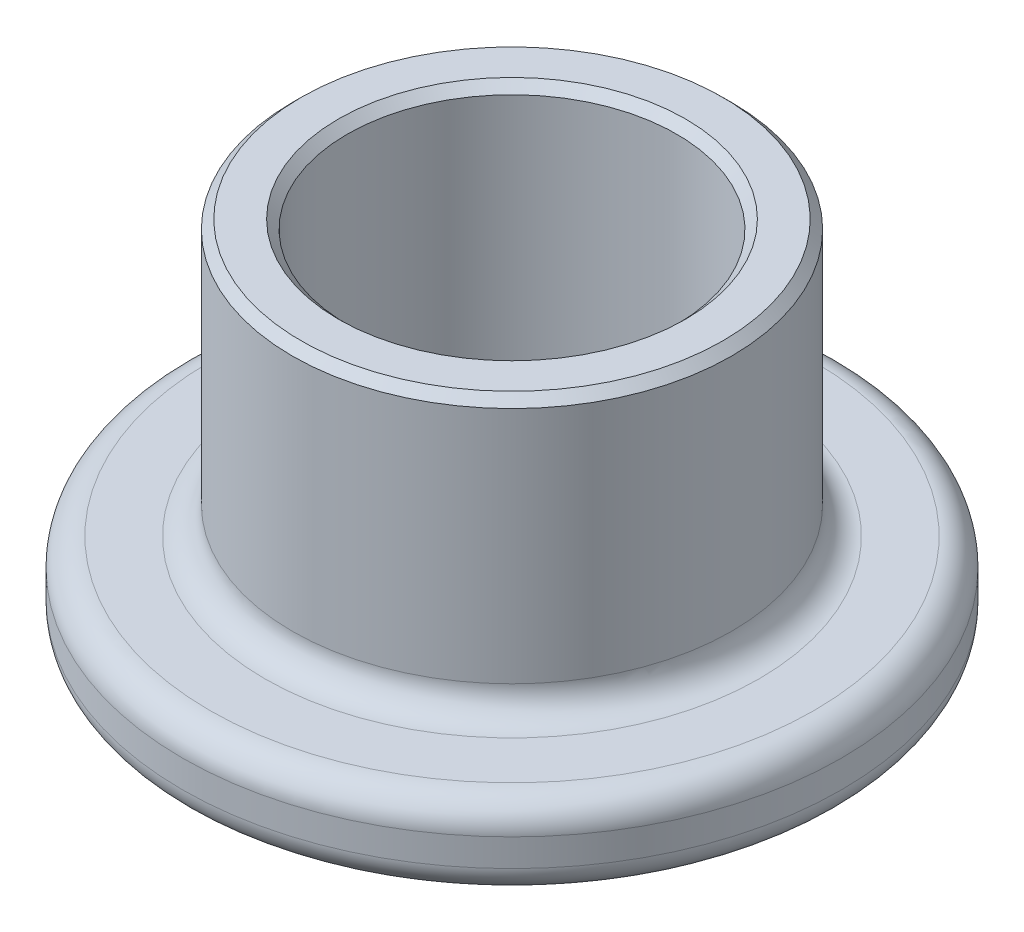
ISO-10303-21;
HEADER;
FILE_DESCRIPTION(('STEP AP214'),'2;1');
FILE_NAME('part.step','',(''),(''),'','','');
FILE_SCHEMA(('AUTOMOTIVE_DESIGN { 1 0 10303 214 1 1 1 1 }'));
ENDSEC;
DATA;
#1=APPLICATION_CONTEXT('core data for automotive mechanical design processes');
#2=APPLICATION_PROTOCOL_DEFINITION('international standard','automotive_design',2000,#1);
#3=PRODUCT_CONTEXT('',#1,'mechanical');
#4=PRODUCT('Part','Part','',(#3));
#5=PRODUCT_RELATED_PRODUCT_CATEGORY('part','',(#4));
#6=PRODUCT_DEFINITION_FORMATION('','',#4);
#7=PRODUCT_DEFINITION_CONTEXT('part definition',#1,'design');
#8=PRODUCT_DEFINITION('design','',#6,#7);
#9=PRODUCT_DEFINITION_SHAPE('','',#8);
#10=(LENGTH_UNIT() NAMED_UNIT(*) SI_UNIT(.MILLI.,.METRE.));
#11=(NAMED_UNIT(*) PLANE_ANGLE_UNIT() SI_UNIT($,.RADIAN.));
#12=(NAMED_UNIT(*) SI_UNIT($,.STERADIAN.) SOLID_ANGLE_UNIT());
#13=UNCERTAINTY_MEASURE_WITH_UNIT(LENGTH_MEASURE(1.E-05),#10,'distance_accuracy_value','');
#14=(GEOMETRIC_REPRESENTATION_CONTEXT(3) GLOBAL_UNCERTAINTY_ASSIGNED_CONTEXT((#13)) GLOBAL_UNIT_ASSIGNED_CONTEXT((#10,
#11,#12)) REPRESENTATION_CONTEXT('',''));
#15=CARTESIAN_POINT('',(0.,0.,0.));
#16=DIRECTION('',(0.,0.,1.));
#17=DIRECTION('',(1.,0.,0.));
#18=AXIS2_PLACEMENT_3D('',#15,#16,#17);
#19=CARTESIAN_POINT('',(0.,1.89666781767956,0.));
#20=DIRECTION('',(0.,1.,0.));
#21=DIRECTION('',(-1.,0.,0.));
#22=AXIS2_PLACEMENT_3D('',#19,#20,#21);
#23=CYLINDRICAL_SURFACE('',#22,2.38125);
#24=CARTESIAN_POINT('',(0.,0.127000000000002,0.));
#25=DIRECTION('',(0.,1.,0.));
#26=DIRECTION('',(-1.,0.,0.));
#27=AXIS2_PLACEMENT_3D('',#24,#25,#26);
#28=CIRCLE('',#27,2.38125);
#29=CARTESIAN_POINT('',(-2.38125,0.127000000000002,0.));
#30=VERTEX_POINT('',#29);
#31=EDGE_CURVE('E45',#30,#30,#28,.F.);
#32=ORIENTED_EDGE('',*,*,#31,.T.);
#33=EDGE_LOOP('',(#32));
#34=FACE_BOUND('',#33,.T.);
#35=CARTESIAN_POINT('',(0.,5.032375,0.));
#36=DIRECTION('',(0.,-1.,0.));
#37=DIRECTION('',(1.,0.,0.));
#38=AXIS2_PLACEMENT_3D('',#35,#36,#37);
#39=CIRCLE('',#38,2.38125);
#40=CARTESIAN_POINT('',(2.38125,5.032375,0.));
#41=VERTEX_POINT('',#40);
#42=EDGE_CURVE('E50',#41,#41,#39,.F.);
#43=ORIENTED_EDGE('',*,*,#42,.T.);
#44=EDGE_LOOP('',(#43));
#45=FACE_BOUND('',#44,.T.);
#46=ADVANCED_FACE('F30',(#34,#45),#23,.F.);
#47=CARTESIAN_POINT('',(2.38125,0.,0.));
#48=DIRECTION('',(0.,1.,0.));
#49=DIRECTION('',(-1.,0.,0.));
#50=AXIS2_PLACEMENT_3D('',#47,#48,#49);
#51=PLANE('',#50);
#52=CARTESIAN_POINT('',(0.,0.,0.));
#53=DIRECTION('',(0.,1.,0.));
#54=DIRECTION('',(-1.,0.,0.));
#55=AXIS2_PLACEMENT_3D('',#52,#53,#54);
#56=CIRCLE('',#55,2.50825);
#57=CARTESIAN_POINT('',(-2.50825,0.,0.));
#58=VERTEX_POINT('',#57);
#59=EDGE_CURVE('E53',#58,#58,#56,.T.);
#60=ORIENTED_EDGE('',*,*,#59,.T.);
#61=EDGE_LOOP('',(#60));
#62=FACE_BOUND('',#61,.T.);
#63=CARTESIAN_POINT('',(0.,0.,0.));
#64=DIRECTION('',(0.,1.,0.));
#65=DIRECTION('',(-1.,0.,0.));
#66=AXIS2_PLACEMENT_3D('',#63,#64,#65);
#67=CIRCLE('',#66,4.365625);
#68=CARTESIAN_POINT('',(-4.365625,0.,0.));
#69=VERTEX_POINT('',#68);
#70=EDGE_CURVE('E65',#69,#69,#67,.F.);
#71=ORIENTED_EDGE('',*,*,#70,.T.);
#72=EDGE_LOOP('',(#71));
#73=FACE_BOUND('',#72,.T.);
#74=ADVANCED_FACE('F106',(#62,#73),#51,.F.);
#75=CARTESIAN_POINT('',(0.,1.89666781767956,0.));
#76=DIRECTION('',(0.,1.,0.));
#77=DIRECTION('',(-1.,0.,0.));
#78=AXIS2_PLACEMENT_3D('',#75,#76,#77);
#79=CYLINDRICAL_SURFACE('',#78,4.7625);
#80=CARTESIAN_POINT('',(0.,0.396875,0.));
#81=DIRECTION('',(0.,1.,0.));
#82=DIRECTION('',(-1.,0.,0.));
#83=AXIS2_PLACEMENT_3D('',#80,#81,#82);
#84=CIRCLE('',#83,4.7625);
#85=CARTESIAN_POINT('',(-4.7625,0.396874999999999,0.));
#86=VERTEX_POINT('',#85);
#87=EDGE_CURVE('E68',#86,#86,#84,.T.);
#88=ORIENTED_EDGE('',*,*,#87,.T.);
#89=EDGE_LOOP('',(#88));
#90=FACE_BOUND('',#89,.T.);
#91=CARTESIAN_POINT('',(0.,0.793749999999999,0.));
#92=DIRECTION('',(0.,-1.,0.));
#93=DIRECTION('',(1.,0.,0.));
#94=AXIS2_PLACEMENT_3D('',#91,#92,#93);
#95=CIRCLE('',#94,4.7625);
#96=CARTESIAN_POINT('',(4.7625,0.79375,0.));
#97=VERTEX_POINT('',#96);
#98=EDGE_CURVE('E71',#97,#97,#95,.T.);
#99=ORIENTED_EDGE('',*,*,#98,.T.);
#100=EDGE_LOOP('',(#99));
#101=FACE_BOUND('',#100,.T.);
#102=ADVANCED_FACE('F75',(#90,#101),#79,.T.);
#103=CARTESIAN_POINT('',(4.7625,1.190625,0.));
#104=DIRECTION('',(0.,-1.,0.));
#105=DIRECTION('',(1.,0.,0.));
#106=AXIS2_PLACEMENT_3D('',#103,#104,#105);
#107=PLANE('',#106);
#108=CARTESIAN_POINT('',(0.,1.190625,0.));
#109=DIRECTION('',(0.,-1.,0.));
#110=DIRECTION('',(1.,0.,0.));
#111=AXIS2_PLACEMENT_3D('',#108,#109,#110);
#112=CIRCLE('',#111,4.365625);
#113=CARTESIAN_POINT('',(4.365625,1.190625,0.));
#114=VERTEX_POINT('',#113);
#115=EDGE_CURVE('E59',#114,#114,#112,.F.);
#116=ORIENTED_EDGE('',*,*,#115,.T.);
#117=EDGE_LOOP('',(#116));
#118=FACE_BOUND('',#117,.T.);
#119=CARTESIAN_POINT('',(0.,1.190625,0.));
#120=DIRECTION('',(0.,-1.,0.));
#121=DIRECTION('',(1.,0.,0.));
#122=AXIS2_PLACEMENT_3D('',#119,#120,#121);
#123=CIRCLE('',#122,3.571875);
#124=CARTESIAN_POINT('',(3.571875,1.190625,0.));
#125=VERTEX_POINT('',#124);
#126=EDGE_CURVE('E62',#125,#125,#123,.T.);
#127=ORIENTED_EDGE('',*,*,#126,.T.);
#128=EDGE_LOOP('',(#127));
#129=FACE_BOUND('',#128,.T.);
#130=ADVANCED_FACE('F85',(#118,#129),#107,.F.);
#131=CARTESIAN_POINT('',(0.,1.89666781767956,0.));
#132=DIRECTION('',(0.,1.,0.));
#133=DIRECTION('',(-1.,0.,0.));
#134=AXIS2_PLACEMENT_3D('',#131,#132,#133);
#135=CYLINDRICAL_SURFACE('',#134,3.175);
#136=CARTESIAN_POINT('',(0.,5.032375,0.));
#137=DIRECTION('',(0.,-1.,0.));
#138=DIRECTION('',(1.,0.,0.));
#139=AXIS2_PLACEMENT_3D('',#136,#137,#138);
#140=CIRCLE('',#139,3.175);
#141=CARTESIAN_POINT('',(3.175,5.032375,0.));
#142=VERTEX_POINT('',#141);
#143=EDGE_CURVE('E10',#142,#142,#140,.T.);
#144=ORIENTED_EDGE('',*,*,#143,.T.);
#145=EDGE_LOOP('',(#144));
#146=FACE_BOUND('',#145,.T.);
#147=CARTESIAN_POINT('',(0.,1.5875,0.));
#148=DIRECTION('',(0.,-1.,0.));
#149=DIRECTION('',(1.,0.,0.));
#150=AXIS2_PLACEMENT_3D('',#147,#148,#149);
#151=CIRCLE('',#150,3.175);
#152=CARTESIAN_POINT('',(3.175,1.5875,0.));
#153=VERTEX_POINT('',#152);
#154=EDGE_CURVE('E56',#153,#153,#151,.F.);
#155=ORIENTED_EDGE('',*,*,#154,.T.);
#156=EDGE_LOOP('',(#155));
#157=FACE_BOUND('',#156,.T.);
#158=ADVANCED_FACE('F88',(#146,#157),#135,.T.);
#159=CARTESIAN_POINT('',(3.175,5.159375,0.));
#160=DIRECTION('',(0.,-1.,0.));
#161=DIRECTION('',(1.,0.,0.));
#162=AXIS2_PLACEMENT_3D('',#159,#160,#161);
#163=PLANE('',#162);
#164=CARTESIAN_POINT('',(0.,5.159375,0.));
#165=DIRECTION('',(0.,-1.,0.));
#166=DIRECTION('',(1.,0.,0.));
#167=AXIS2_PLACEMENT_3D('',#164,#165,#166);
#168=CIRCLE('',#167,3.048);
#169=CARTESIAN_POINT('',(3.048,5.159375,0.));
#170=VERTEX_POINT('',#169);
#171=EDGE_CURVE('E37',#170,#170,#168,.F.);
#172=ORIENTED_EDGE('',*,*,#171,.T.);
#173=EDGE_LOOP('',(#172));
#174=FACE_BOUND('',#173,.T.);
#175=CARTESIAN_POINT('',(0.,5.159375,0.));
#176=DIRECTION('',(0.,-1.,0.));
#177=DIRECTION('',(1.,0.,0.));
#178=AXIS2_PLACEMENT_3D('',#175,#176,#177);
#179=CIRCLE('',#178,2.50825);
#180=CARTESIAN_POINT('',(2.50825,5.159375,0.));
#181=VERTEX_POINT('',#180);
#182=EDGE_CURVE('E41',#181,#181,#179,.T.);
#183=ORIENTED_EDGE('',*,*,#182,.T.);
#184=EDGE_LOOP('',(#183));
#185=FACE_BOUND('',#184,.T.);
#186=ADVANCED_FACE('F99',(#174,#185),#163,.F.);
#187=CARTESIAN_POINT('',(0.,0.396875,0.));
#188=DIRECTION('',(0.,1.,0.));
#189=DIRECTION('',(-1.,0.,0.));
#190=AXIS2_PLACEMENT_3D('',#187,#188,#189);
#191=TOROIDAL_SURFACE('',#190,4.365625,0.396875);
#192=ORIENTED_EDGE('',*,*,#70,.F.);
#193=EDGE_LOOP('',(#192));
#194=FACE_BOUND('',#193,.T.);
#195=ORIENTED_EDGE('',*,*,#87,.F.);
#196=EDGE_LOOP('',(#195));
#197=FACE_BOUND('',#196,.T.);
#198=ADVANCED_FACE('F81',(#194,#197),#191,.T.);
#199=CARTESIAN_POINT('',(0.,0.793749999999999,0.));
#200=DIRECTION('',(0.,-1.,0.));
#201=DIRECTION('',(1.,0.,0.));
#202=AXIS2_PLACEMENT_3D('',#199,#200,#201);
#203=TOROIDAL_SURFACE('',#202,4.365625,0.396875);
#204=ORIENTED_EDGE('',*,*,#98,.F.);
#205=EDGE_LOOP('',(#204));
#206=FACE_BOUND('',#205,.T.);
#207=ORIENTED_EDGE('',*,*,#115,.F.);
#208=EDGE_LOOP('',(#207));
#209=FACE_BOUND('',#208,.T.);
#210=ADVANCED_FACE('F77',(#206,#209),#203,.T.);
#211=CARTESIAN_POINT('',(0.,1.5875,0.));
#212=DIRECTION('',(0.,-1.,0.));
#213=DIRECTION('',(1.,0.,0.));
#214=AXIS2_PLACEMENT_3D('',#211,#212,#213);
#215=TOROIDAL_SURFACE('',#214,3.571875,0.396875);
#216=ORIENTED_EDGE('',*,*,#126,.F.);
#217=EDGE_LOOP('',(#216));
#218=FACE_BOUND('',#217,.T.);
#219=ORIENTED_EDGE('',*,*,#154,.F.);
#220=EDGE_LOOP('',(#219));
#221=FACE_BOUND('',#220,.T.);
#222=ADVANCED_FACE('F80',(#218,#221),#215,.F.);
#223=CARTESIAN_POINT('',(0.,0.,0.));
#224=DIRECTION('',(0.,-1.,0.));
#225=DIRECTION('',(1.,0.,0.));
#226=AXIS2_PLACEMENT_3D('',#223,#224,#225);
#227=CONICAL_SURFACE('',#226,2.50825,0.785398163397448);
#228=ORIENTED_EDGE('',*,*,#31,.F.);
#229=EDGE_LOOP('',(#228));
#230=FACE_BOUND('',#229,.T.);
#231=ORIENTED_EDGE('',*,*,#59,.F.);
#232=EDGE_LOOP('',(#231));
#233=FACE_BOUND('',#232,.T.);
#234=ADVANCED_FACE('F94',(#230,#233),#227,.F.);
#235=CARTESIAN_POINT('',(0.,5.159375,0.));
#236=DIRECTION('',(0.,-1.,0.));
#237=DIRECTION('',(1.,0.,0.));
#238=AXIS2_PLACEMENT_3D('',#235,#236,#237);
#239=CONICAL_SURFACE('',#238,3.048,0.78539816339744);
#240=ORIENTED_EDGE('',*,*,#143,.F.);
#241=EDGE_LOOP('',(#240));
#242=FACE_BOUND('',#241,.T.);
#243=ORIENTED_EDGE('',*,*,#171,.F.);
#244=EDGE_LOOP('',(#243));
#245=FACE_BOUND('',#244,.T.);
#246=ADVANCED_FACE('F121',(#242,#245),#239,.T.);
#247=CARTESIAN_POINT('',(0.,5.032375,0.));
#248=DIRECTION('',(0.,1.,0.));
#249=DIRECTION('',(-1.,0.,0.));
#250=AXIS2_PLACEMENT_3D('',#247,#248,#249);
#251=CONICAL_SURFACE('',#250,2.38125,0.785398163397445);
#252=ORIENTED_EDGE('',*,*,#182,.F.);
#253=EDGE_LOOP('',(#252));
#254=FACE_BOUND('',#253,.T.);
#255=ORIENTED_EDGE('',*,*,#42,.F.);
#256=EDGE_LOOP('',(#255));
#257=FACE_BOUND('',#256,.T.);
#258=ADVANCED_FACE('F32',(#254,#257),#251,.F.);
#259=CLOSED_SHELL('',(#46,#74,#102,#130,#158,#186,#198,#210,#222,#234,#246,#258));
#260=MANIFOLD_SOLID_BREP('B2',#259);
#261=ADVANCED_BREP_SHAPE_REPRESENTATION('',(#18,#260),#14);
#262=SHAPE_DEFINITION_REPRESENTATION(#9,#261);
ENDSEC;
END-ISO-10303-21;
